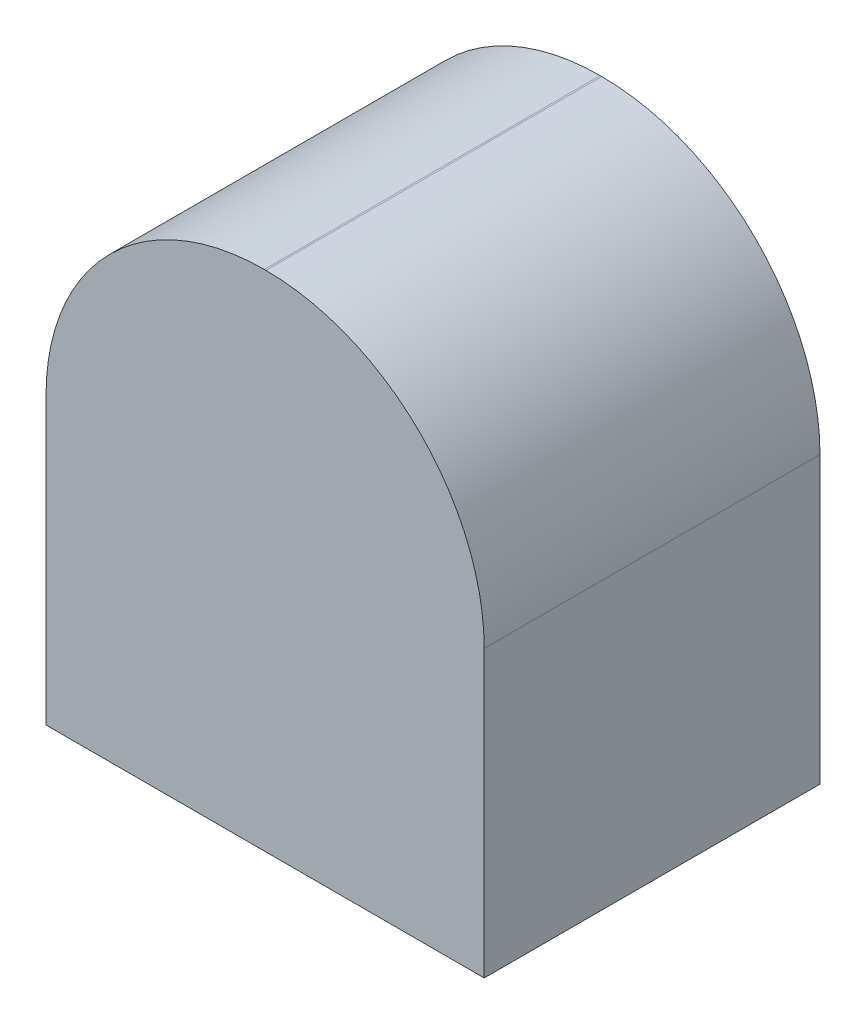
ISO-10303-21;
HEADER;
FILE_DESCRIPTION(('STEP AP214'),'2;1');
FILE_NAME('part.step','',(''),(''),'','','');
FILE_SCHEMA(('AUTOMOTIVE_DESIGN { 1 0 10303 214 1 1 1 1 }'));
ENDSEC;
DATA;
#1=APPLICATION_CONTEXT('core data for automotive mechanical design processes');
#2=APPLICATION_PROTOCOL_DEFINITION('international standard','automotive_design',2000,#1);
#3=PRODUCT_CONTEXT('',#1,'mechanical');
#4=PRODUCT('Part','Part','',(#3));
#5=PRODUCT_RELATED_PRODUCT_CATEGORY('part','',(#4));
#6=PRODUCT_DEFINITION_FORMATION('','',#4);
#7=PRODUCT_DEFINITION_CONTEXT('part definition',#1,'design');
#8=PRODUCT_DEFINITION('design','',#6,#7);
#9=PRODUCT_DEFINITION_SHAPE('','',#8);
#10=(LENGTH_UNIT() NAMED_UNIT(*) SI_UNIT(.MILLI.,.METRE.));
#11=(NAMED_UNIT(*) PLANE_ANGLE_UNIT() SI_UNIT($,.RADIAN.));
#12=(NAMED_UNIT(*) SI_UNIT($,.STERADIAN.) SOLID_ANGLE_UNIT());
#13=UNCERTAINTY_MEASURE_WITH_UNIT(LENGTH_MEASURE(1.E-05),#10,'distance_accuracy_value','');
#14=(GEOMETRIC_REPRESENTATION_CONTEXT(3) GLOBAL_UNCERTAINTY_ASSIGNED_CONTEXT((#13)) GLOBAL_UNIT_ASSIGNED_CONTEXT((#10,
#11,#12)) REPRESENTATION_CONTEXT('',''));
#15=CARTESIAN_POINT('',(0.,0.,0.));
#16=DIRECTION('',(0.,0.,1.));
#17=DIRECTION('',(1.,0.,0.));
#18=AXIS2_PLACEMENT_3D('',#15,#16,#17);
#19=CARTESIAN_POINT('',(1.36949942,0.,0.1999996));
#20=DIRECTION('',(0.,0.,-1.));
#21=DIRECTION('',(-1.,0.,0.));
#22=AXIS2_PLACEMENT_3D('',#19,#20,#21);
#23=PLANE('',#22);
#24=DIRECTION('',(1.,0.,0.));
#25=VECTOR('',#24,1.);
#26=CARTESIAN_POINT('',(1.63049966,0.2999994,0.1999996));
#27=LINE('',#26,#25);
#28=CARTESIAN_POINT('',(1.49949942,0.2999994,0.1999996));
#29=VERTEX_POINT('',#28);
#30=CARTESIAN_POINT('',(1.50049966,0.2999994,0.1999996));
#31=VERTEX_POINT('',#30);
#32=EDGE_CURVE('E11',#29,#31,#27,.T.);
#33=ORIENTED_EDGE('',*,*,#32,.F.);
#34=CARTESIAN_POINT('',(1.49949942,0.1699994,0.1999996));
#35=DIRECTION('',(0.,0.,-1.));
#36=DIRECTION('',(1.,0.,0.));
#37=AXIS2_PLACEMENT_3D('',#34,#35,#36);
#38=CIRCLE('',#37,0.13);
#39=CARTESIAN_POINT('',(1.36949942,0.1699994,0.1999996));
#40=VERTEX_POINT('',#39);
#41=EDGE_CURVE('E24',#40,#29,#38,.T.);
#42=ORIENTED_EDGE('',*,*,#41,.F.);
#43=DIRECTION('',(0.,1.,0.));
#44=VECTOR('',#43,1.);
#45=CARTESIAN_POINT('',(1.36949942,0.,0.1999996));
#46=LINE('',#45,#44);
#47=CARTESIAN_POINT('',(1.36949942,0.,0.1999996));
#48=VERTEX_POINT('',#47);
#49=EDGE_CURVE('E117',#48,#40,#46,.T.);
#50=ORIENTED_EDGE('',*,*,#49,.F.);
#51=DIRECTION('',(-1.,0.,0.));
#52=VECTOR('',#51,1.);
#53=CARTESIAN_POINT('',(1.36949942,0.,0.1999996));
#54=LINE('',#53,#52);
#55=CARTESIAN_POINT('',(1.63049966,0.,0.1999996));
#56=VERTEX_POINT('',#55);
#57=EDGE_CURVE('E115',#56,#48,#54,.T.);
#58=ORIENTED_EDGE('',*,*,#57,.F.);
#59=DIRECTION('',(0.,-1.,0.));
#60=VECTOR('',#59,1.);
#61=CARTESIAN_POINT('',(1.63049966,0.,0.1999996));
#62=LINE('',#61,#60);
#63=CARTESIAN_POINT('',(1.63049966,0.1699994,0.1999996));
#64=VERTEX_POINT('',#63);
#65=EDGE_CURVE('E73',#64,#56,#62,.T.);
#66=ORIENTED_EDGE('',*,*,#65,.F.);
#67=CARTESIAN_POINT('',(1.50049966,0.1699994,0.1999996));
#68=DIRECTION('',(0.,0.,-1.));
#69=DIRECTION('',(1.,0.,0.));
#70=AXIS2_PLACEMENT_3D('',#67,#68,#69);
#71=CIRCLE('',#70,0.13);
#72=EDGE_CURVE('E111',#31,#64,#71,.T.);
#73=ORIENTED_EDGE('',*,*,#72,.F.);
#74=EDGE_LOOP('',(#33,#42,#50,#58,#66,#73));
#75=FACE_BOUND('',#74,.T.);
#76=ADVANCED_FACE('F17',(#75),#23,.F.);
#77=CARTESIAN_POINT('',(1.50049966,0.1699994,0.));
#78=DIRECTION('',(0.,0.,1.));
#79=DIRECTION('',(1.,0.,0.));
#80=AXIS2_PLACEMENT_3D('',#77,#78,#79);
#81=CYLINDRICAL_SURFACE('',#80,0.13);
#82=ORIENTED_EDGE('',*,*,#72,.T.);
#83=DIRECTION('',(0.,0.,-1.));
#84=VECTOR('',#83,1.);
#85=CARTESIAN_POINT('',(1.63049966,0.1699994,0.));
#86=LINE('',#85,#84);
#87=CARTESIAN_POINT('',(1.63049966,0.1699994,0.));
#88=VERTEX_POINT('',#87);
#89=EDGE_CURVE('E109',#64,#88,#86,.T.);
#90=ORIENTED_EDGE('',*,*,#89,.T.);
#91=CARTESIAN_POINT('',(1.50049966,0.1699994,0.));
#92=DIRECTION('',(0.,0.,1.));
#93=DIRECTION('',(1.,0.,0.));
#94=AXIS2_PLACEMENT_3D('',#91,#92,#93);
#95=CIRCLE('',#94,0.13);
#96=CARTESIAN_POINT('',(1.50049966,0.2999994,0.));
#97=VERTEX_POINT('',#96);
#98=EDGE_CURVE('E89',#88,#97,#95,.T.);
#99=ORIENTED_EDGE('',*,*,#98,.T.);
#100=DIRECTION('',(0.,0.,1.));
#101=VECTOR('',#100,1.);
#102=CARTESIAN_POINT('',(1.50049966,0.2999994,0.));
#103=LINE('',#102,#101);
#104=EDGE_CURVE('E105',#97,#31,#103,.T.);
#105=ORIENTED_EDGE('',*,*,#104,.T.);
#106=EDGE_LOOP('',(#82,#90,#99,#105));
#107=FACE_BOUND('',#106,.T.);
#108=ADVANCED_FACE('F127',(#107),#81,.T.);
#109=CARTESIAN_POINT('',(1.63049966,0.2999994,0.));
#110=DIRECTION('',(0.,-1.,0.));
#111=DIRECTION('',(0.,0.,-1.));
#112=AXIS2_PLACEMENT_3D('',#109,#110,#111);
#113=PLANE('',#112);
#114=DIRECTION('',(1.,0.,0.));
#115=VECTOR('',#114,1.);
#116=CARTESIAN_POINT('',(1.36949942,0.2999994,0.));
#117=LINE('',#116,#115);
#118=CARTESIAN_POINT('',(1.49949942,0.2999994,0.));
#119=VERTEX_POINT('',#118);
#120=EDGE_CURVE('E103',#119,#97,#117,.T.);
#121=ORIENTED_EDGE('',*,*,#120,.F.);
#122=DIRECTION('',(0.,0.,-1.));
#123=VECTOR('',#122,1.);
#124=CARTESIAN_POINT('',(1.49949942,0.2999994,0.));
#125=LINE('',#124,#123);
#126=EDGE_CURVE('E100',#29,#119,#125,.T.);
#127=ORIENTED_EDGE('',*,*,#126,.F.);
#128=ORIENTED_EDGE('',*,*,#32,.T.);
#129=ORIENTED_EDGE('',*,*,#104,.F.);
#130=EDGE_LOOP('',(#121,#127,#128,#129));
#131=FACE_BOUND('',#130,.T.);
#132=ADVANCED_FACE('F123',(#131),#113,.F.);
#133=CARTESIAN_POINT('',(1.49949942,0.1699994,0.));
#134=DIRECTION('',(0.,0.,1.));
#135=DIRECTION('',(1.,0.,0.));
#136=AXIS2_PLACEMENT_3D('',#133,#134,#135);
#137=CYLINDRICAL_SURFACE('',#136,0.13);
#138=ORIENTED_EDGE('',*,*,#41,.T.);
#139=ORIENTED_EDGE('',*,*,#126,.T.);
#140=CARTESIAN_POINT('',(1.49949942,0.1699994,0.));
#141=DIRECTION('',(0.,0.,1.));
#142=DIRECTION('',(1.,0.,0.));
#143=AXIS2_PLACEMENT_3D('',#140,#141,#142);
#144=CIRCLE('',#143,0.13);
#145=CARTESIAN_POINT('',(1.36949942,0.1699994,0.));
#146=VERTEX_POINT('',#145);
#147=EDGE_CURVE('E98',#119,#146,#144,.T.);
#148=ORIENTED_EDGE('',*,*,#147,.T.);
#149=DIRECTION('',(0.,0.,1.));
#150=VECTOR('',#149,1.);
#151=CARTESIAN_POINT('',(1.36949942,0.1699994,0.));
#152=LINE('',#151,#150);
#153=EDGE_CURVE('E95',#146,#40,#152,.T.);
#154=ORIENTED_EDGE('',*,*,#153,.T.);
#155=EDGE_LOOP('',(#138,#139,#148,#154));
#156=FACE_BOUND('',#155,.T.);
#157=ADVANCED_FACE('F120',(#156),#137,.T.);
#158=CARTESIAN_POINT('',(1.36949942,0.2999994,0.));
#159=DIRECTION('',(1.,0.,0.));
#160=DIRECTION('',(0.,0.,-1.));
#161=AXIS2_PLACEMENT_3D('',#158,#159,#160);
#162=PLANE('',#161);
#163=DIRECTION('',(0.,1.,0.));
#164=VECTOR('',#163,1.);
#165=CARTESIAN_POINT('',(1.36949942,0.2999994,0.));
#166=LINE('',#165,#164);
#167=CARTESIAN_POINT('',(1.36949942,0.,0.));
#168=VERTEX_POINT('',#167);
#169=EDGE_CURVE('E93',#168,#146,#166,.T.);
#170=ORIENTED_EDGE('',*,*,#169,.F.);
#171=DIRECTION('',(0.,0.,-1.));
#172=VECTOR('',#171,1.);
#173=CARTESIAN_POINT('',(1.36949942,0.,0.));
#174=LINE('',#173,#172);
#175=EDGE_CURVE('E76',#48,#168,#174,.T.);
#176=ORIENTED_EDGE('',*,*,#175,.F.);
#177=ORIENTED_EDGE('',*,*,#49,.T.);
#178=ORIENTED_EDGE('',*,*,#153,.F.);
#179=EDGE_LOOP('',(#170,#176,#177,#178));
#180=FACE_BOUND('',#179,.T.);
#181=ADVANCED_FACE('F125',(#180),#162,.F.);
#182=CARTESIAN_POINT('',(1.36949942,0.,0.));
#183=DIRECTION('',(0.,1.,0.));
#184=DIRECTION('',(0.,0.,1.));
#185=AXIS2_PLACEMENT_3D('',#182,#183,#184);
#186=PLANE('',#185);
#187=DIRECTION('',(0.,0.,-1.));
#188=VECTOR('',#187,1.);
#189=CARTESIAN_POINT('',(1.63049966,0.,0.));
#190=LINE('',#189,#188);
#191=CARTESIAN_POINT('',(1.63049966,0.,0.));
#192=VERTEX_POINT('',#191);
#193=EDGE_CURVE('E67',#56,#192,#190,.T.);
#194=ORIENTED_EDGE('',*,*,#193,.F.);
#195=ORIENTED_EDGE('',*,*,#57,.T.);
#196=ORIENTED_EDGE('',*,*,#175,.T.);
#197=DIRECTION('',(-1.,0.,0.));
#198=VECTOR('',#197,1.);
#199=CARTESIAN_POINT('',(1.36949942,0.,0.));
#200=LINE('',#199,#198);
#201=EDGE_CURVE('E77',#192,#168,#200,.T.);
#202=ORIENTED_EDGE('',*,*,#201,.F.);
#203=EDGE_LOOP('',(#194,#195,#196,#202));
#204=FACE_BOUND('',#203,.T.);
#205=ADVANCED_FACE('F81',(#204),#186,.F.);
#206=CARTESIAN_POINT('',(1.63049966,0.,0.));
#207=DIRECTION('',(-1.,0.,0.));
#208=DIRECTION('',(0.,0.,1.));
#209=AXIS2_PLACEMENT_3D('',#206,#207,#208);
#210=PLANE('',#209);
#211=DIRECTION('',(0.,-1.,0.));
#212=VECTOR('',#211,1.);
#213=CARTESIAN_POINT('',(1.63049966,0.,0.));
#214=LINE('',#213,#212);
#215=EDGE_CURVE('E72',#88,#192,#214,.T.);
#216=ORIENTED_EDGE('',*,*,#215,.F.);
#217=ORIENTED_EDGE('',*,*,#89,.F.);
#218=ORIENTED_EDGE('',*,*,#65,.T.);
#219=ORIENTED_EDGE('',*,*,#193,.T.);
#220=EDGE_LOOP('',(#216,#217,#218,#219));
#221=FACE_BOUND('',#220,.T.);
#222=ADVANCED_FACE('F69',(#221),#210,.F.);
#223=CARTESIAN_POINT('',(1.36949942,0.,0.));
#224=DIRECTION('',(0.,0.,-1.));
#225=DIRECTION('',(-1.,0.,0.));
#226=AXIS2_PLACEMENT_3D('',#223,#224,#225);
#227=PLANE('',#226);
#228=ORIENTED_EDGE('',*,*,#120,.T.);
#229=ORIENTED_EDGE('',*,*,#98,.F.);
#230=ORIENTED_EDGE('',*,*,#215,.T.);
#231=ORIENTED_EDGE('',*,*,#201,.T.);
#232=ORIENTED_EDGE('',*,*,#169,.T.);
#233=ORIENTED_EDGE('',*,*,#147,.F.);
#234=EDGE_LOOP('',(#228,#229,#230,#231,#232,#233));
#235=FACE_BOUND('',#234,.T.);
#236=ADVANCED_FACE('F88',(#235),#227,.T.);
#237=CLOSED_SHELL('',(#76,#108,#132,#157,#181,#205,#222,#236));
#238=MANIFOLD_SOLID_BREP('B1',#237);
#239=ADVANCED_BREP_SHAPE_REPRESENTATION('',(#18,#238),#14);
#240=SHAPE_DEFINITION_REPRESENTATION(#9,#239);
ENDSEC;
END-ISO-10303-21;
